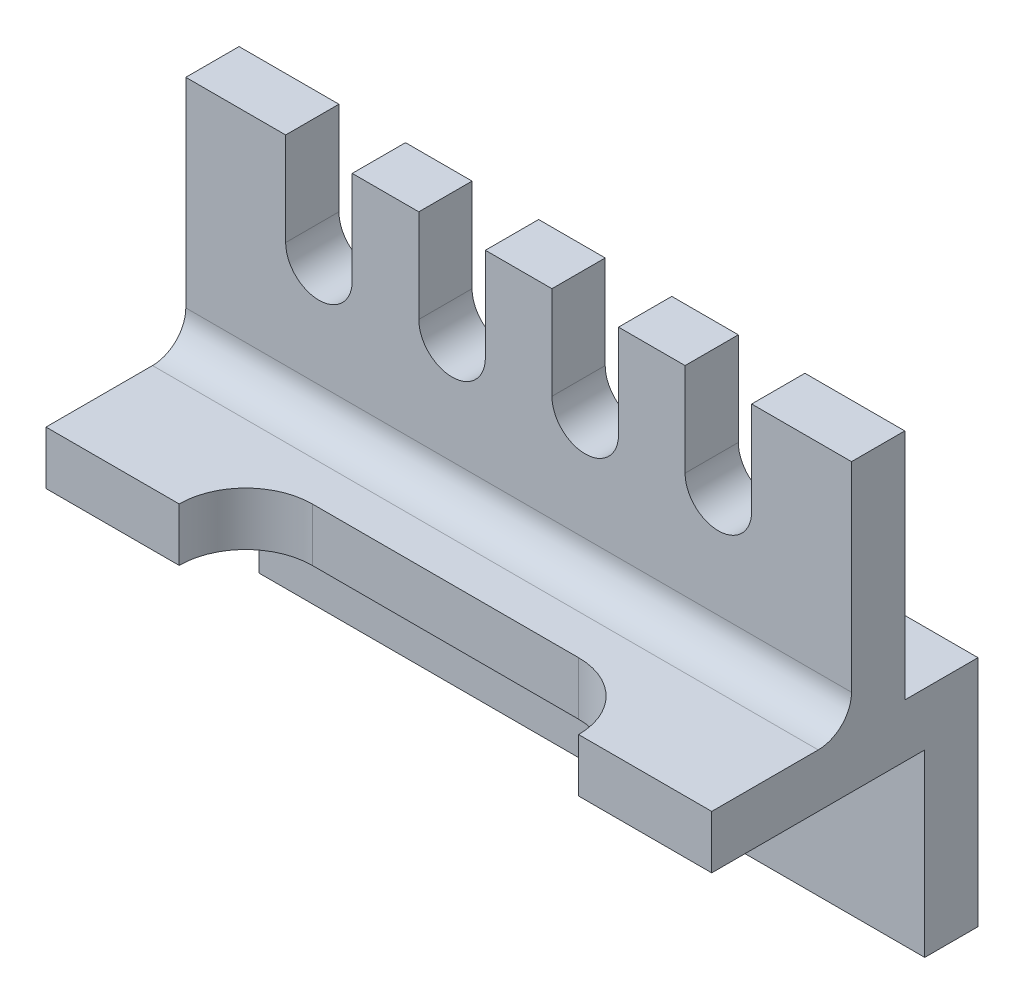
ISO-10303-21;
HEADER;
FILE_DESCRIPTION(('STEP AP214'),'2;1');
FILE_NAME('part.step','',(''),(''),'','','');
FILE_SCHEMA(('AUTOMOTIVE_DESIGN { 1 0 10303 214 1 1 1 1 }'));
ENDSEC;
DATA;
#1=APPLICATION_CONTEXT('core data for automotive mechanical design processes');
#2=APPLICATION_PROTOCOL_DEFINITION('international standard','automotive_design',2000,#1);
#3=PRODUCT_CONTEXT('',#1,'mechanical');
#4=PRODUCT('Part','Part','',(#3));
#5=PRODUCT_RELATED_PRODUCT_CATEGORY('part','',(#4));
#6=PRODUCT_DEFINITION_FORMATION('','',#4);
#7=PRODUCT_DEFINITION_CONTEXT('part definition',#1,'design');
#8=PRODUCT_DEFINITION('design','',#6,#7);
#9=PRODUCT_DEFINITION_SHAPE('','',#8);
#10=(LENGTH_UNIT() NAMED_UNIT(*) SI_UNIT(.MILLI.,.METRE.));
#11=(NAMED_UNIT(*) PLANE_ANGLE_UNIT() SI_UNIT($,.RADIAN.));
#12=(NAMED_UNIT(*) SI_UNIT($,.STERADIAN.) SOLID_ANGLE_UNIT());
#13=UNCERTAINTY_MEASURE_WITH_UNIT(LENGTH_MEASURE(1.E-05),#10,'distance_accuracy_value','');
#14=(GEOMETRIC_REPRESENTATION_CONTEXT(3) GLOBAL_UNCERTAINTY_ASSIGNED_CONTEXT((#13)) GLOBAL_UNIT_ASSIGNED_CONTEXT((#10,
#11,#12)) REPRESENTATION_CONTEXT('',''));
#15=CARTESIAN_POINT('',(0.,0.,0.));
#16=DIRECTION('',(0.,0.,1.));
#17=DIRECTION('',(1.,0.,0.));
#18=AXIS2_PLACEMENT_3D('',#15,#16,#17);
#19=CARTESIAN_POINT('',(0.,70.,0.));
#20=DIRECTION('',(0.,1.,0.));
#21=DIRECTION('',(0.,0.,1.));
#22=AXIS2_PLACEMENT_3D('',#19,#20,#21);
#23=PLANE('',#22);
#24=DIRECTION('',(0.,0.,1.));
#25=VECTOR('',#24,1.);
#26=CARTESIAN_POINT('',(-75.,70.,11.));
#27=LINE('',#26,#25);
#28=CARTESIAN_POINT('',(-75.,70.,11.));
#29=VERTEX_POINT('',#28);
#30=CARTESIAN_POINT('',(-75.,70.,19.));
#31=VERTEX_POINT('',#30);
#32=EDGE_CURVE('E274',#29,#31,#27,.T.);
#33=ORIENTED_EDGE('',*,*,#32,.T.);
#34=DIRECTION('',(1.,0.,0.));
#35=VECTOR('',#34,1.);
#36=CARTESIAN_POINT('',(-100.,70.,19.));
#37=LINE('',#36,#35);
#38=CARTESIAN_POINT('',(-65.,70.,19.));
#39=VERTEX_POINT('',#38);
#40=EDGE_CURVE('E365',#31,#39,#37,.T.);
#41=ORIENTED_EDGE('',*,*,#40,.T.);
#42=DIRECTION('',(0.,0.,1.));
#43=VECTOR('',#42,1.);
#44=CARTESIAN_POINT('',(-65.,70.,11.));
#45=LINE('',#44,#43);
#46=CARTESIAN_POINT('',(-65.,70.,11.));
#47=VERTEX_POINT('',#46);
#48=EDGE_CURVE('E280',#47,#39,#45,.T.);
#49=ORIENTED_EDGE('',*,*,#48,.F.);
#50=DIRECTION('',(-1.,0.,0.));
#51=VECTOR('',#50,1.);
#52=CARTESIAN_POINT('',(-100.,70.,11.));
#53=LINE('',#52,#51);
#54=EDGE_CURVE('E501',#47,#29,#53,.T.);
#55=ORIENTED_EDGE('',*,*,#54,.T.);
#56=EDGE_LOOP('',(#33,#41,#49,#55));
#57=FACE_BOUND('',#56,.T.);
#58=ADVANCED_FACE('F39',(#57),#23,.T.);
#59=DIRECTION('',(0.,0.,1.));
#60=VECTOR('',#59,1.);
#61=CARTESIAN_POINT('',(-55.,70.,11.));
#62=LINE('',#61,#60);
#63=CARTESIAN_POINT('',(-55.,70.,11.));
#64=VERTEX_POINT('',#63);
#65=CARTESIAN_POINT('',(-55.,70.,19.));
#66=VERTEX_POINT('',#65);
#67=EDGE_CURVE('E287',#64,#66,#62,.T.);
#68=ORIENTED_EDGE('',*,*,#67,.T.);
#69=CARTESIAN_POINT('',(-45.,70.,19.));
#70=VERTEX_POINT('',#69);
#71=EDGE_CURVE('E480',#66,#70,#37,.T.);
#72=ORIENTED_EDGE('',*,*,#71,.T.);
#73=DIRECTION('',(0.,0.,1.));
#74=VECTOR('',#73,1.);
#75=CARTESIAN_POINT('',(-45.,70.,11.));
#76=LINE('',#75,#74);
#77=CARTESIAN_POINT('',(-45.,70.,11.));
#78=VERTEX_POINT('',#77);
#79=EDGE_CURVE('E306',#78,#70,#76,.T.);
#80=ORIENTED_EDGE('',*,*,#79,.F.);
#81=EDGE_CURVE('E502',#78,#64,#53,.T.);
#82=ORIENTED_EDGE('',*,*,#81,.T.);
#83=EDGE_LOOP('',(#68,#72,#80,#82));
#84=FACE_BOUND('',#83,.T.);
#85=ADVANCED_FACE('F518',(#84),#23,.T.);
#86=DIRECTION('',(0.,0.,1.));
#87=VECTOR('',#86,1.);
#88=CARTESIAN_POINT('',(-35.,70.,11.));
#89=LINE('',#88,#87);
#90=CARTESIAN_POINT('',(-35.,70.,11.));
#91=VERTEX_POINT('',#90);
#92=CARTESIAN_POINT('',(-35.,70.,19.));
#93=VERTEX_POINT('',#92);
#94=EDGE_CURVE('E313',#91,#93,#89,.T.);
#95=ORIENTED_EDGE('',*,*,#94,.T.);
#96=CARTESIAN_POINT('',(-25.,70.,19.));
#97=VERTEX_POINT('',#96);
#98=EDGE_CURVE('E478',#93,#97,#37,.T.);
#99=ORIENTED_EDGE('',*,*,#98,.T.);
#100=DIRECTION('',(0.,0.,1.));
#101=VECTOR('',#100,1.);
#102=CARTESIAN_POINT('',(-25.,70.,11.));
#103=LINE('',#102,#101);
#104=CARTESIAN_POINT('',(-25.,70.,11.));
#105=VERTEX_POINT('',#104);
#106=EDGE_CURVE('E332',#105,#97,#103,.T.);
#107=ORIENTED_EDGE('',*,*,#106,.F.);
#108=EDGE_CURVE('E371',#105,#91,#53,.T.);
#109=ORIENTED_EDGE('',*,*,#108,.T.);
#110=EDGE_LOOP('',(#95,#99,#107,#109));
#111=FACE_BOUND('',#110,.T.);
#112=ADVANCED_FACE('F524',(#111),#23,.T.);
#113=DIRECTION('',(0.,0.,1.));
#114=VECTOR('',#113,1.);
#115=CARTESIAN_POINT('',(-15.,70.,11.));
#116=LINE('',#115,#114);
#117=CARTESIAN_POINT('',(-15.,70.,11.));
#118=VERTEX_POINT('',#117);
#119=CARTESIAN_POINT('',(-15.,70.,19.));
#120=VERTEX_POINT('',#119);
#121=EDGE_CURVE('E339',#118,#120,#116,.T.);
#122=ORIENTED_EDGE('',*,*,#121,.T.);
#123=CARTESIAN_POINT('',(0.,70.,19.));
#124=VERTEX_POINT('',#123);
#125=EDGE_CURVE('E360',#120,#124,#37,.T.);
#126=ORIENTED_EDGE('',*,*,#125,.T.);
#127=DIRECTION('',(0.,0.,-1.));
#128=VECTOR('',#127,1.);
#129=CARTESIAN_POINT('',(0.,70.,11.));
#130=LINE('',#129,#128);
#131=CARTESIAN_POINT('',(0.,70.,11.));
#132=VERTEX_POINT('',#131);
#133=EDGE_CURVE('E364',#124,#132,#130,.T.);
#134=ORIENTED_EDGE('',*,*,#133,.T.);
#135=EDGE_CURVE('E367',#132,#118,#53,.T.);
#136=ORIENTED_EDGE('',*,*,#135,.T.);
#137=EDGE_LOOP('',(#122,#126,#134,#136));
#138=FACE_BOUND('',#137,.T.);
#139=ADVANCED_FACE('F476',(#138),#23,.T.);
#140=CARTESIAN_POINT('',(0.,35.,0.));
#141=DIRECTION('',(0.,-1.,0.));
#142=DIRECTION('',(0.,0.,-1.));
#143=AXIS2_PLACEMENT_3D('',#140,#141,#142);
#144=PLANE('',#143);
#145=DIRECTION('',(-1.,0.,0.));
#146=VECTOR('',#145,1.);
#147=CARTESIAN_POINT('',(-100.,35.,11.));
#148=LINE('',#147,#146);
#149=CARTESIAN_POINT('',(0.,35.,11.));
#150=VERTEX_POINT('',#149);
#151=CARTESIAN_POINT('',(-100.,35.,11.));
#152=VERTEX_POINT('',#151);
#153=EDGE_CURVE('E277',#150,#152,#148,.T.);
#154=ORIENTED_EDGE('',*,*,#153,.F.);
#155=DIRECTION('',(0.,0.,-1.));
#156=VECTOR('',#155,1.);
#157=CARTESIAN_POINT('',(0.,35.,0.));
#158=LINE('',#157,#156);
#159=CARTESIAN_POINT('',(0.,35.,0.));
#160=VERTEX_POINT('',#159);
#161=EDGE_CURVE('E419',#150,#160,#158,.T.);
#162=ORIENTED_EDGE('',*,*,#161,.T.);
#163=DIRECTION('',(-1.,0.,0.));
#164=VECTOR('',#163,1.);
#165=CARTESIAN_POINT('',(0.,35.,0.));
#166=LINE('',#165,#164);
#167=CARTESIAN_POINT('',(-100.,35.,0.));
#168=VERTEX_POINT('',#167);
#169=EDGE_CURVE('E418',#160,#168,#166,.T.);
#170=ORIENTED_EDGE('',*,*,#169,.T.);
#171=DIRECTION('',(0.,0.,1.));
#172=VECTOR('',#171,1.);
#173=CARTESIAN_POINT('',(-100.,35.,0.));
#174=LINE('',#173,#172);
#175=EDGE_CURVE('E422',#168,#152,#174,.T.);
#176=ORIENTED_EDGE('',*,*,#175,.T.);
#177=EDGE_LOOP('',(#154,#162,#170,#176));
#178=FACE_BOUND('',#177,.T.);
#179=ADVANCED_FACE('F536',(#178),#144,.F.);
#180=CARTESIAN_POINT('',(0.,35.,40.));
#181=VERTEX_POINT('',#180);
#182=CARTESIAN_POINT('',(0.,35.,24.));
#183=VERTEX_POINT('',#182);
#184=EDGE_CURVE('E416',#181,#183,#158,.T.);
#185=ORIENTED_EDGE('',*,*,#184,.T.);
#186=DIRECTION('',(1.,0.,0.));
#187=VECTOR('',#186,1.);
#188=CARTESIAN_POINT('',(-100.,35.,24.));
#189=LINE('',#188,#187);
#190=CARTESIAN_POINT('',(-100.,35.,24.));
#191=VERTEX_POINT('',#190);
#192=EDGE_CURVE('E60',#183,#191,#189,.F.);
#193=ORIENTED_EDGE('',*,*,#192,.T.);
#194=CARTESIAN_POINT('',(-100.,35.,40.));
#195=VERTEX_POINT('',#194);
#196=EDGE_CURVE('E421',#191,#195,#174,.T.);
#197=ORIENTED_EDGE('',*,*,#196,.T.);
#198=DIRECTION('',(-1.,0.,0.));
#199=VECTOR('',#198,1.);
#200=CARTESIAN_POINT('',(-100.,35.,40.));
#201=LINE('',#200,#199);
#202=CARTESIAN_POINT('',(-80.,35.,40.));
#203=VERTEX_POINT('',#202);
#204=EDGE_CURVE('E406',#203,#195,#201,.T.);
#205=ORIENTED_EDGE('',*,*,#204,.F.);
#206=CARTESIAN_POINT('',(-70.,35.,40.));
#207=DIRECTION('',(0.,-1.,0.));
#208=DIRECTION('',(0.,0.,-1.));
#209=AXIS2_PLACEMENT_3D('',#206,#207,#208);
#210=CIRCLE('',#209,10.);
#211=CARTESIAN_POINT('',(-70.,35.,30.));
#212=VERTEX_POINT('',#211);
#213=EDGE_CURVE('E457',#203,#212,#210,.T.);
#214=ORIENTED_EDGE('',*,*,#213,.T.);
#215=DIRECTION('',(-1.,0.,0.));
#216=VECTOR('',#215,1.);
#217=CARTESIAN_POINT('',(-80.,35.,30.));
#218=LINE('',#217,#216);
#219=CARTESIAN_POINT('',(-30.,35.,30.));
#220=VERTEX_POINT('',#219);
#221=EDGE_CURVE('E388',#220,#212,#218,.T.);
#222=ORIENTED_EDGE('',*,*,#221,.F.);
#223=CARTESIAN_POINT('',(-30.,35.,40.));
#224=DIRECTION('',(0.,-1.,0.));
#225=DIRECTION('',(0.,0.,-1.));
#226=AXIS2_PLACEMENT_3D('',#223,#224,#225);
#227=CIRCLE('',#226,10.);
#228=CARTESIAN_POINT('',(-20.,35.,40.));
#229=VERTEX_POINT('',#228);
#230=EDGE_CURVE('E451',#220,#229,#227,.T.);
#231=ORIENTED_EDGE('',*,*,#230,.T.);
#232=EDGE_CURVE('E407',#181,#229,#201,.T.);
#233=ORIENTED_EDGE('',*,*,#232,.F.);
#234=EDGE_LOOP('',(#185,#193,#197,#205,#214,#222,#231,#233));
#235=FACE_BOUND('',#234,.T.);
#236=ADVANCED_FACE('F540',(#235),#144,.F.);
#237=CARTESIAN_POINT('',(0.,0.,40.));
#238=DIRECTION('',(0.,0.,1.));
#239=DIRECTION('',(1.,0.,0.));
#240=AXIS2_PLACEMENT_3D('',#237,#238,#239);
#241=PLANE('',#240);
#242=DIRECTION('',(0.,-1.,0.));
#243=VECTOR('',#242,1.);
#244=CARTESIAN_POINT('',(-80.,35.,40.));
#245=LINE('',#244,#243);
#246=CARTESIAN_POINT('',(-80.,27.,40.));
#247=VERTEX_POINT('',#246);
#248=EDGE_CURVE('E384',#203,#247,#245,.T.);
#249=ORIENTED_EDGE('',*,*,#248,.F.);
#250=ORIENTED_EDGE('',*,*,#204,.T.);
#251=DIRECTION('',(0.,-1.,0.));
#252=VECTOR('',#251,1.);
#253=CARTESIAN_POINT('',(-100.,35.,40.));
#254=LINE('',#253,#252);
#255=CARTESIAN_POINT('',(-100.,27.,40.));
#256=VERTEX_POINT('',#255);
#257=EDGE_CURVE('E392',#195,#256,#254,.T.);
#258=ORIENTED_EDGE('',*,*,#257,.T.);
#259=DIRECTION('',(1.,0.,0.));
#260=VECTOR('',#259,1.);
#261=CARTESIAN_POINT('',(-100.,27.,40.));
#262=LINE('',#261,#260);
#263=EDGE_CURVE('E400',#256,#247,#262,.T.);
#264=ORIENTED_EDGE('',*,*,#263,.T.);
#265=EDGE_LOOP('',(#249,#250,#258,#264));
#266=FACE_BOUND('',#265,.T.);
#267=ADVANCED_FACE('F664',(#266),#241,.T.);
#268=CARTESIAN_POINT('',(0.,35.,8.));
#269=DIRECTION('',(0.,0.,-1.));
#270=DIRECTION('',(-1.,0.,0.));
#271=AXIS2_PLACEMENT_3D('',#268,#269,#270);
#272=PLANE('',#271);
#273=DIRECTION('',(1.,0.,0.));
#274=VECTOR('',#273,1.);
#275=CARTESIAN_POINT('',(0.,27.,8.));
#276=LINE('',#275,#274);
#277=CARTESIAN_POINT('',(-100.,27.,8.00000000000001));
#278=VERTEX_POINT('',#277);
#279=CARTESIAN_POINT('',(0.,27.,8.));
#280=VERTEX_POINT('',#279);
#281=EDGE_CURVE('E443',#278,#280,#276,.T.);
#282=ORIENTED_EDGE('',*,*,#281,.F.);
#283=DIRECTION('',(0.,-1.,0.));
#284=VECTOR('',#283,1.);
#285=CARTESIAN_POINT('',(-100.,35.,8.00000000000001));
#286=LINE('',#285,#284);
#287=CARTESIAN_POINT('',(-100.,0.,8.00000000000001));
#288=VERTEX_POINT('',#287);
#289=EDGE_CURVE('E437',#278,#288,#286,.T.);
#290=ORIENTED_EDGE('',*,*,#289,.T.);
#291=DIRECTION('',(1.,0.,0.));
#292=VECTOR('',#291,1.);
#293=CARTESIAN_POINT('',(0.,0.,8.));
#294=LINE('',#293,#292);
#295=CARTESIAN_POINT('',(0.,0.,8.));
#296=VERTEX_POINT('',#295);
#297=EDGE_CURVE('E433',#288,#296,#294,.T.);
#298=ORIENTED_EDGE('',*,*,#297,.T.);
#299=DIRECTION('',(0.,-1.,0.));
#300=VECTOR('',#299,1.);
#301=CARTESIAN_POINT('',(0.,35.,8.));
#302=LINE('',#301,#300);
#303=EDGE_CURVE('E424',#280,#296,#302,.T.);
#304=ORIENTED_EDGE('',*,*,#303,.F.);
#305=EDGE_LOOP('',(#282,#290,#298,#304));
#306=FACE_BOUND('',#305,.T.);
#307=ADVANCED_FACE('F673',(#306),#272,.F.);
#308=CARTESIAN_POINT('',(0.,35.,0.));
#309=DIRECTION('',(-1.,0.,0.));
#310=DIRECTION('',(0.,0.,1.));
#311=AXIS2_PLACEMENT_3D('',#308,#309,#310);
#312=PLANE('',#311);
#313=ORIENTED_EDGE('',*,*,#184,.F.);
#314=DIRECTION('',(0.,1.,0.));
#315=VECTOR('',#314,1.);
#316=CARTESIAN_POINT('',(0.,35.,40.));
#317=LINE('',#316,#315);
#318=CARTESIAN_POINT('',(0.,27.,40.));
#319=VERTEX_POINT('',#318);
#320=EDGE_CURVE('E403',#319,#181,#317,.T.);
#321=ORIENTED_EDGE('',*,*,#320,.F.);
#322=DIRECTION('',(0.,0.,-1.));
#323=VECTOR('',#322,1.);
#324=CARTESIAN_POINT('',(0.,27.,40.));
#325=LINE('',#324,#323);
#326=EDGE_CURVE('E410',#319,#280,#325,.T.);
#327=ORIENTED_EDGE('',*,*,#326,.T.);
#328=ORIENTED_EDGE('',*,*,#303,.T.);
#329=DIRECTION('',(0.,0.,-1.));
#330=VECTOR('',#329,1.);
#331=CARTESIAN_POINT('',(0.,0.,0.));
#332=LINE('',#331,#330);
#333=CARTESIAN_POINT('',(0.,0.,0.));
#334=VERTEX_POINT('',#333);
#335=EDGE_CURVE('E415',#296,#334,#332,.T.);
#336=ORIENTED_EDGE('',*,*,#335,.T.);
#337=DIRECTION('',(0.,-1.,0.));
#338=VECTOR('',#337,1.);
#339=CARTESIAN_POINT('',(0.,35.,0.));
#340=LINE('',#339,#338);
#341=EDGE_CURVE('E441',#160,#334,#340,.T.);
#342=ORIENTED_EDGE('',*,*,#341,.F.);
#343=ORIENTED_EDGE('',*,*,#161,.F.);
#344=DIRECTION('',(0.,-1.,0.));
#345=VECTOR('',#344,1.);
#346=CARTESIAN_POINT('',(0.,70.,11.));
#347=LINE('',#346,#345);
#348=EDGE_CURVE('E376',#132,#150,#347,.T.);
#349=ORIENTED_EDGE('',*,*,#348,.F.);
#350=ORIENTED_EDGE('',*,*,#133,.F.);
#351=DIRECTION('',(0.,-1.,0.));
#352=VECTOR('',#351,1.);
#353=CARTESIAN_POINT('',(0.,70.,19.));
#354=LINE('',#353,#352);
#355=CARTESIAN_POINT('',(0.,40.,19.));
#356=VERTEX_POINT('',#355);
#357=EDGE_CURVE('E379',#124,#356,#354,.T.);
#358=ORIENTED_EDGE('',*,*,#357,.T.);
#359=CARTESIAN_POINT('',(0.,40.,24.));
#360=DIRECTION('',(-1.,0.,0.));
#361=DIRECTION('',(0.,0.,1.));
#362=AXIS2_PLACEMENT_3D('',#359,#360,#361);
#363=CIRCLE('',#362,5.);
#364=EDGE_CURVE('E47',#356,#183,#363,.T.);
#365=ORIENTED_EDGE('',*,*,#364,.T.);
#366=EDGE_LOOP('',(#313,#321,#327,#328,#336,#342,#343,#349,#350,#358,#365));
#367=FACE_BOUND('',#366,.T.);
#368=ADVANCED_FACE('F471',(#367),#312,.F.);
#369=CARTESIAN_POINT('',(0.,35.,0.));
#370=DIRECTION('',(0.,0.,1.));
#371=DIRECTION('',(1.,0.,0.));
#372=AXIS2_PLACEMENT_3D('',#369,#370,#371);
#373=PLANE('',#372);
#374=ORIENTED_EDGE('',*,*,#341,.T.);
#375=DIRECTION('',(-1.,0.,0.));
#376=VECTOR('',#375,1.);
#377=CARTESIAN_POINT('',(0.,0.,0.));
#378=LINE('',#377,#376);
#379=CARTESIAN_POINT('',(-100.,0.,0.));
#380=VERTEX_POINT('',#379);
#381=EDGE_CURVE('E427',#334,#380,#378,.T.);
#382=ORIENTED_EDGE('',*,*,#381,.T.);
#383=DIRECTION('',(0.,-1.,0.));
#384=VECTOR('',#383,1.);
#385=CARTESIAN_POINT('',(-100.,35.,0.));
#386=LINE('',#385,#384);
#387=EDGE_CURVE('E439',#168,#380,#386,.T.);
#388=ORIENTED_EDGE('',*,*,#387,.F.);
#389=ORIENTED_EDGE('',*,*,#169,.F.);
#390=EDGE_LOOP('',(#374,#382,#388,#389));
#391=FACE_BOUND('',#390,.T.);
#392=ADVANCED_FACE('F672',(#391),#373,.F.);
#393=CARTESIAN_POINT('',(-100.,35.,0.));
#394=DIRECTION('',(1.,0.,0.));
#395=DIRECTION('',(0.,0.,-1.));
#396=AXIS2_PLACEMENT_3D('',#393,#394,#395);
#397=PLANE('',#396);
#398=ORIENTED_EDGE('',*,*,#387,.T.);
#399=DIRECTION('',(0.,0.,1.));
#400=VECTOR('',#399,1.);
#401=CARTESIAN_POINT('',(-100.,0.,0.));
#402=LINE('',#401,#400);
#403=EDGE_CURVE('E430',#380,#288,#402,.T.);
#404=ORIENTED_EDGE('',*,*,#403,.T.);
#405=ORIENTED_EDGE('',*,*,#289,.F.);
#406=DIRECTION('',(0.,0.,-1.));
#407=VECTOR('',#406,1.);
#408=CARTESIAN_POINT('',(-100.,27.,40.));
#409=LINE('',#408,#407);
#410=EDGE_CURVE('E413',#256,#278,#409,.T.);
#411=ORIENTED_EDGE('',*,*,#410,.F.);
#412=ORIENTED_EDGE('',*,*,#257,.F.);
#413=ORIENTED_EDGE('',*,*,#196,.F.);
#414=CARTESIAN_POINT('',(-100.,40.,24.));
#415=DIRECTION('',(1.,0.,0.));
#416=DIRECTION('',(0.,0.,-1.));
#417=AXIS2_PLACEMENT_3D('',#414,#415,#416);
#418=CIRCLE('',#417,5.);
#419=CARTESIAN_POINT('',(-100.,40.,19.));
#420=VERTEX_POINT('',#419);
#421=EDGE_CURVE('E11',#191,#420,#418,.T.);
#422=ORIENTED_EDGE('',*,*,#421,.T.);
#423=DIRECTION('',(0.,-1.,0.));
#424=VECTOR('',#423,1.);
#425=CARTESIAN_POINT('',(-100.,70.,19.));
#426=LINE('',#425,#424);
#427=CARTESIAN_POINT('',(-100.,70.,19.));
#428=VERTEX_POINT('',#427);
#429=EDGE_CURVE('E381',#428,#420,#426,.T.);
#430=ORIENTED_EDGE('',*,*,#429,.F.);
#431=DIRECTION('',(0.,0.,1.));
#432=VECTOR('',#431,1.);
#433=CARTESIAN_POINT('',(-100.,70.,11.));
#434=LINE('',#433,#432);
#435=CARTESIAN_POINT('',(-100.,70.,11.));
#436=VERTEX_POINT('',#435);
#437=EDGE_CURVE('E357',#436,#428,#434,.T.);
#438=ORIENTED_EDGE('',*,*,#437,.F.);
#439=DIRECTION('',(0.,-1.,0.));
#440=VECTOR('',#439,1.);
#441=CARTESIAN_POINT('',(-100.,70.,11.));
#442=LINE('',#441,#440);
#443=EDGE_CURVE('E370',#436,#152,#442,.T.);
#444=ORIENTED_EDGE('',*,*,#443,.T.);
#445=ORIENTED_EDGE('',*,*,#175,.F.);
#446=EDGE_LOOP('',(#398,#404,#405,#411,#412,#413,#422,#430,#438,#444,#445));
#447=FACE_BOUND('',#446,.T.);
#448=ADVANCED_FACE('F509',(#447),#397,.F.);
#449=CARTESIAN_POINT('',(0.,0.,0.));
#450=DIRECTION('',(0.,-1.,0.));
#451=DIRECTION('',(0.,0.,-1.));
#452=AXIS2_PLACEMENT_3D('',#449,#450,#451);
#453=PLANE('',#452);
#454=ORIENTED_EDGE('',*,*,#335,.F.);
#455=ORIENTED_EDGE('',*,*,#297,.F.);
#456=ORIENTED_EDGE('',*,*,#403,.F.);
#457=ORIENTED_EDGE('',*,*,#381,.F.);
#458=EDGE_LOOP('',(#454,#455,#456,#457));
#459=FACE_BOUND('',#458,.T.);
#460=ADVANCED_FACE('F681',(#459),#453,.T.);
#461=CARTESIAN_POINT('',(-100.,27.,40.));
#462=DIRECTION('',(0.,1.,0.));
#463=DIRECTION('',(0.,0.,1.));
#464=AXIS2_PLACEMENT_3D('',#461,#462,#463);
#465=PLANE('',#464);
#466=DIRECTION('',(1.,0.,0.));
#467=VECTOR('',#466,1.);
#468=CARTESIAN_POINT('',(-80.,27.,30.));
#469=LINE('',#468,#467);
#470=CARTESIAN_POINT('',(-70.,27.,30.));
#471=VERTEX_POINT('',#470);
#472=CARTESIAN_POINT('',(-30.,27.,30.));
#473=VERTEX_POINT('',#472);
#474=EDGE_CURVE('E385',#471,#473,#469,.T.);
#475=ORIENTED_EDGE('',*,*,#474,.F.);
#476=CARTESIAN_POINT('',(-70.,27.,40.));
#477=DIRECTION('',(0.,1.,0.));
#478=DIRECTION('',(0.,0.,1.));
#479=AXIS2_PLACEMENT_3D('',#476,#477,#478);
#480=CIRCLE('',#479,10.);
#481=EDGE_CURVE('E455',#471,#247,#480,.T.);
#482=ORIENTED_EDGE('',*,*,#481,.T.);
#483=ORIENTED_EDGE('',*,*,#263,.F.);
#484=ORIENTED_EDGE('',*,*,#410,.T.);
#485=ORIENTED_EDGE('',*,*,#281,.T.);
#486=ORIENTED_EDGE('',*,*,#326,.F.);
#487=CARTESIAN_POINT('',(-20.,27.,40.));
#488=VERTEX_POINT('',#487);
#489=EDGE_CURVE('E399',#488,#319,#262,.T.);
#490=ORIENTED_EDGE('',*,*,#489,.F.);
#491=CARTESIAN_POINT('',(-30.,27.,40.));
#492=DIRECTION('',(0.,1.,0.));
#493=DIRECTION('',(0.,0.,1.));
#494=AXIS2_PLACEMENT_3D('',#491,#492,#493);
#495=CIRCLE('',#494,10.);
#496=EDGE_CURVE('E453',#488,#473,#495,.T.);
#497=ORIENTED_EDGE('',*,*,#496,.T.);
#498=EDGE_LOOP('',(#475,#482,#483,#484,#485,#486,#490,#497));
#499=FACE_BOUND('',#498,.T.);
#500=ADVANCED_FACE('F767',(#499),#465,.F.);
#501=DIRECTION('',(0.,1.,0.));
#502=VECTOR('',#501,1.);
#503=CARTESIAN_POINT('',(-20.,35.,40.));
#504=LINE('',#503,#502);
#505=EDGE_CURVE('E389',#488,#229,#504,.T.);
#506=ORIENTED_EDGE('',*,*,#505,.F.);
#507=ORIENTED_EDGE('',*,*,#489,.T.);
#508=ORIENTED_EDGE('',*,*,#320,.T.);
#509=ORIENTED_EDGE('',*,*,#232,.T.);
#510=EDGE_LOOP('',(#506,#507,#508,#509));
#511=FACE_BOUND('',#510,.T.);
#512=ADVANCED_FACE('F757',(#511),#241,.T.);
#513=CARTESIAN_POINT('',(0.,0.,30.));
#514=DIRECTION('',(0.,0.,1.));
#515=DIRECTION('',(1.,0.,0.));
#516=AXIS2_PLACEMENT_3D('',#513,#514,#515);
#517=PLANE('',#516);
#518=ORIENTED_EDGE('',*,*,#474,.T.);
#519=DIRECTION('',(0.,1.,0.));
#520=VECTOR('',#519,1.);
#521=CARTESIAN_POINT('',(-30.,0.,30.));
#522=LINE('',#521,#520);
#523=EDGE_CURVE('E448',#473,#220,#522,.T.);
#524=ORIENTED_EDGE('',*,*,#523,.T.);
#525=ORIENTED_EDGE('',*,*,#221,.T.);
#526=DIRECTION('',(0.,-1.,0.));
#527=VECTOR('',#526,1.);
#528=CARTESIAN_POINT('',(-70.,0.,30.));
#529=LINE('',#528,#527);
#530=EDGE_CURVE('E445',#212,#471,#529,.T.);
#531=ORIENTED_EDGE('',*,*,#530,.T.);
#532=EDGE_LOOP('',(#518,#524,#525,#531));
#533=FACE_BOUND('',#532,.T.);
#534=ADVANCED_FACE('F748',(#533),#517,.T.);
#535=CARTESIAN_POINT('',(-30.,0.,40.));
#536=DIRECTION('',(0.,1.,0.));
#537=DIRECTION('',(0.,0.,1.));
#538=AXIS2_PLACEMENT_3D('',#535,#536,#537);
#539=CYLINDRICAL_SURFACE('',#538,10.);
#540=ORIENTED_EDGE('',*,*,#496,.F.);
#541=ORIENTED_EDGE('',*,*,#505,.T.);
#542=ORIENTED_EDGE('',*,*,#230,.F.);
#543=ORIENTED_EDGE('',*,*,#523,.F.);
#544=EDGE_LOOP('',(#540,#541,#542,#543));
#545=FACE_BOUND('',#544,.T.);
#546=ADVANCED_FACE('F740',(#545),#539,.F.);
#547=CARTESIAN_POINT('',(-70.,0.,40.));
#548=DIRECTION('',(0.,-1.,0.));
#549=DIRECTION('',(0.,0.,-1.));
#550=AXIS2_PLACEMENT_3D('',#547,#548,#549);
#551=CYLINDRICAL_SURFACE('',#550,10.);
#552=ORIENTED_EDGE('',*,*,#213,.F.);
#553=ORIENTED_EDGE('',*,*,#248,.T.);
#554=ORIENTED_EDGE('',*,*,#481,.F.);
#555=ORIENTED_EDGE('',*,*,#530,.F.);
#556=EDGE_LOOP('',(#552,#553,#554,#555));
#557=FACE_BOUND('',#556,.T.);
#558=ADVANCED_FACE('F688',(#557),#551,.F.);
#559=CARTESIAN_POINT('',(-100.,70.,19.));
#560=DIRECTION('',(0.,0.,-1.));
#561=DIRECTION('',(-1.,0.,0.));
#562=AXIS2_PLACEMENT_3D('',#559,#560,#561);
#563=PLANE('',#562);
#564=ORIENTED_EDGE('',*,*,#429,.T.);
#565=DIRECTION('',(1.,0.,0.));
#566=VECTOR('',#565,1.);
#567=CARTESIAN_POINT('',(0.,40.,19.));
#568=LINE('',#567,#566);
#569=EDGE_CURVE('E459',#420,#356,#568,.T.);
#570=ORIENTED_EDGE('',*,*,#569,.T.);
#571=ORIENTED_EDGE('',*,*,#357,.F.);
#572=ORIENTED_EDGE('',*,*,#125,.F.);
#573=DIRECTION('',(0.,1.,0.));
#574=VECTOR('',#573,1.);
#575=CARTESIAN_POINT('',(-15.,56.,19.));
#576=LINE('',#575,#574);
#577=CARTESIAN_POINT('',(-15.,56.,19.));
#578=VERTEX_POINT('',#577);
#579=EDGE_CURVE('E342',#578,#120,#576,.T.);
#580=ORIENTED_EDGE('',*,*,#579,.F.);
#581=CARTESIAN_POINT('',(-20.,56.,19.));
#582=DIRECTION('',(0.,0.,1.));
#583=DIRECTION('',(1.,0.,0.));
#584=AXIS2_PLACEMENT_3D('',#581,#582,#583);
#585=CIRCLE('',#584,5.);
#586=CARTESIAN_POINT('',(-25.,56.,19.));
#587=VERTEX_POINT('',#586);
#588=EDGE_CURVE('E344',#587,#578,#585,.T.);
#589=ORIENTED_EDGE('',*,*,#588,.F.);
#590=DIRECTION('',(0.,-1.,0.));
#591=VECTOR('',#590,1.);
#592=CARTESIAN_POINT('',(-25.,70.,19.));
#593=LINE('',#592,#591);
#594=EDGE_CURVE('E316',#97,#587,#593,.T.);
#595=ORIENTED_EDGE('',*,*,#594,.F.);
#596=ORIENTED_EDGE('',*,*,#98,.F.);
#597=DIRECTION('',(0.,1.,0.));
#598=VECTOR('',#597,1.);
#599=CARTESIAN_POINT('',(-35.,56.,19.));
#600=LINE('',#599,#598);
#601=CARTESIAN_POINT('',(-35.,56.,19.));
#602=VERTEX_POINT('',#601);
#603=EDGE_CURVE('E317',#602,#93,#600,.T.);
#604=ORIENTED_EDGE('',*,*,#603,.F.);
#605=CARTESIAN_POINT('',(-40.,56.,19.));
#606=DIRECTION('',(0.,0.,1.));
#607=DIRECTION('',(1.,0.,0.));
#608=AXIS2_PLACEMENT_3D('',#605,#606,#607);
#609=CIRCLE('',#608,5.);
#610=CARTESIAN_POINT('',(-45.,56.,19.));
#611=VERTEX_POINT('',#610);
#612=EDGE_CURVE('E319',#611,#602,#609,.T.);
#613=ORIENTED_EDGE('',*,*,#612,.F.);
#614=DIRECTION('',(0.,-1.,0.));
#615=VECTOR('',#614,1.);
#616=CARTESIAN_POINT('',(-45.,70.,19.));
#617=LINE('',#616,#615);
#618=EDGE_CURVE('E290',#70,#611,#617,.T.);
#619=ORIENTED_EDGE('',*,*,#618,.F.);
#620=ORIENTED_EDGE('',*,*,#71,.F.);
#621=DIRECTION('',(0.,1.,0.));
#622=VECTOR('',#621,1.);
#623=CARTESIAN_POINT('',(-55.,56.,19.));
#624=LINE('',#623,#622);
#625=CARTESIAN_POINT('',(-55.,56.,19.));
#626=VERTEX_POINT('',#625);
#627=EDGE_CURVE('E291',#626,#66,#624,.T.);
#628=ORIENTED_EDGE('',*,*,#627,.F.);
#629=CARTESIAN_POINT('',(-60.,56.,19.));
#630=DIRECTION('',(0.,0.,1.));
#631=DIRECTION('',(1.,0.,0.));
#632=AXIS2_PLACEMENT_3D('',#629,#630,#631);
#633=CIRCLE('',#632,5.);
#634=CARTESIAN_POINT('',(-65.,56.,19.));
#635=VERTEX_POINT('',#634);
#636=EDGE_CURVE('E293',#635,#626,#633,.T.);
#637=ORIENTED_EDGE('',*,*,#636,.F.);
#638=DIRECTION('',(0.,-1.,0.));
#639=VECTOR('',#638,1.);
#640=CARTESIAN_POINT('',(-65.,70.,19.));
#641=LINE('',#640,#639);
#642=EDGE_CURVE('E272',#39,#635,#641,.T.);
#643=ORIENTED_EDGE('',*,*,#642,.F.);
#644=ORIENTED_EDGE('',*,*,#40,.F.);
#645=DIRECTION('',(0.,1.,0.));
#646=VECTOR('',#645,1.);
#647=CARTESIAN_POINT('',(-75.,56.,19.));
#648=LINE('',#647,#646);
#649=CARTESIAN_POINT('',(-75.,56.,19.));
#650=VERTEX_POINT('',#649);
#651=EDGE_CURVE('E265',#650,#31,#648,.T.);
#652=ORIENTED_EDGE('',*,*,#651,.F.);
#653=CARTESIAN_POINT('',(-80.,56.,19.));
#654=DIRECTION('',(0.,0.,1.));
#655=DIRECTION('',(1.,0.,0.));
#656=AXIS2_PLACEMENT_3D('',#653,#654,#655);
#657=CIRCLE('',#656,5.00000000000001);
#658=CARTESIAN_POINT('',(-85.,56.,19.));
#659=VERTEX_POINT('',#658);
#660=EDGE_CURVE('E267',#659,#650,#657,.T.);
#661=ORIENTED_EDGE('',*,*,#660,.F.);
#662=DIRECTION('',(0.,-1.,0.));
#663=VECTOR('',#662,1.);
#664=CARTESIAN_POINT('',(-85.,70.,19.));
#665=LINE('',#664,#663);
#666=CARTESIAN_POINT('',(-85.,70.,19.));
#667=VERTEX_POINT('',#666);
#668=EDGE_CURVE('E246',#667,#659,#665,.T.);
#669=ORIENTED_EDGE('',*,*,#668,.F.);
#670=EDGE_CURVE('E361',#428,#667,#37,.T.);
#671=ORIENTED_EDGE('',*,*,#670,.F.);
#672=EDGE_LOOP('',(#564,#570,#571,#572,#580,#589,#595,#596,#604,#613,#619,#620,#628,#637,#643,
#644,#652,#661,#669,#671));
#673=FACE_BOUND('',#672,.T.);
#674=ADVANCED_FACE('F465',(#673),#563,.F.);
#675=CARTESIAN_POINT('',(-100.,70.,11.));
#676=DIRECTION('',(0.,0.,1.));
#677=DIRECTION('',(1.,0.,0.));
#678=AXIS2_PLACEMENT_3D('',#675,#676,#677);
#679=PLANE('',#678);
#680=CARTESIAN_POINT('',(-80.,56.,11.));
#681=DIRECTION('',(0.,0.,1.));
#682=DIRECTION('',(1.,0.,0.));
#683=AXIS2_PLACEMENT_3D('',#680,#681,#682);
#684=CIRCLE('',#683,5.00000000000001);
#685=CARTESIAN_POINT('',(-85.,56.,11.));
#686=VERTEX_POINT('',#685);
#687=CARTESIAN_POINT('',(-75.,56.,11.));
#688=VERTEX_POINT('',#687);
#689=EDGE_CURVE('E254',#686,#688,#684,.T.);
#690=ORIENTED_EDGE('',*,*,#689,.T.);
#691=DIRECTION('',(0.,1.,0.));
#692=VECTOR('',#691,1.);
#693=CARTESIAN_POINT('',(-75.,56.,11.));
#694=LINE('',#693,#692);
#695=EDGE_CURVE('E259',#688,#29,#694,.T.);
#696=ORIENTED_EDGE('',*,*,#695,.T.);
#697=ORIENTED_EDGE('',*,*,#54,.F.);
#698=DIRECTION('',(0.,-1.,0.));
#699=VECTOR('',#698,1.);
#700=CARTESIAN_POINT('',(-65.,70.,11.));
#701=LINE('',#700,#699);
#702=CARTESIAN_POINT('',(-65.,56.,11.));
#703=VERTEX_POINT('',#702);
#704=EDGE_CURVE('E294',#47,#703,#701,.T.);
#705=ORIENTED_EDGE('',*,*,#704,.T.);
#706=CARTESIAN_POINT('',(-60.,56.,11.));
#707=DIRECTION('',(0.,0.,1.));
#708=DIRECTION('',(1.,0.,0.));
#709=AXIS2_PLACEMENT_3D('',#706,#707,#708);
#710=CIRCLE('',#709,5.);
#711=CARTESIAN_POINT('',(-55.,56.,11.));
#712=VERTEX_POINT('',#711);
#713=EDGE_CURVE('E301',#703,#712,#710,.T.);
#714=ORIENTED_EDGE('',*,*,#713,.T.);
#715=DIRECTION('',(0.,1.,0.));
#716=VECTOR('',#715,1.);
#717=CARTESIAN_POINT('',(-55.,56.,11.));
#718=LINE('',#717,#716);
#719=EDGE_CURVE('E282',#712,#64,#718,.T.);
#720=ORIENTED_EDGE('',*,*,#719,.T.);
#721=ORIENTED_EDGE('',*,*,#81,.F.);
#722=DIRECTION('',(0.,-1.,0.));
#723=VECTOR('',#722,1.);
#724=CARTESIAN_POINT('',(-45.,70.,11.));
#725=LINE('',#724,#723);
#726=CARTESIAN_POINT('',(-45.,56.,11.));
#727=VERTEX_POINT('',#726);
#728=EDGE_CURVE('E320',#78,#727,#725,.T.);
#729=ORIENTED_EDGE('',*,*,#728,.T.);
#730=CARTESIAN_POINT('',(-40.,56.,11.));
#731=DIRECTION('',(0.,0.,1.));
#732=DIRECTION('',(1.,0.,0.));
#733=AXIS2_PLACEMENT_3D('',#730,#731,#732);
#734=CIRCLE('',#733,5.);
#735=CARTESIAN_POINT('',(-35.,56.,11.));
#736=VERTEX_POINT('',#735);
#737=EDGE_CURVE('E327',#727,#736,#734,.T.);
#738=ORIENTED_EDGE('',*,*,#737,.T.);
#739=DIRECTION('',(0.,1.,0.));
#740=VECTOR('',#739,1.);
#741=CARTESIAN_POINT('',(-35.,56.,11.));
#742=LINE('',#741,#740);
#743=EDGE_CURVE('E308',#736,#91,#742,.T.);
#744=ORIENTED_EDGE('',*,*,#743,.T.);
#745=ORIENTED_EDGE('',*,*,#108,.F.);
#746=DIRECTION('',(0.,-1.,0.));
#747=VECTOR('',#746,1.);
#748=CARTESIAN_POINT('',(-25.,70.,11.));
#749=LINE('',#748,#747);
#750=CARTESIAN_POINT('',(-25.,56.,11.));
#751=VERTEX_POINT('',#750);
#752=EDGE_CURVE('E345',#105,#751,#749,.T.);
#753=ORIENTED_EDGE('',*,*,#752,.T.);
#754=CARTESIAN_POINT('',(-20.,56.,11.));
#755=DIRECTION('',(0.,0.,1.));
#756=DIRECTION('',(1.,0.,0.));
#757=AXIS2_PLACEMENT_3D('',#754,#755,#756);
#758=CIRCLE('',#757,5.);
#759=CARTESIAN_POINT('',(-15.,56.,11.));
#760=VERTEX_POINT('',#759);
#761=EDGE_CURVE('E352',#751,#760,#758,.T.);
#762=ORIENTED_EDGE('',*,*,#761,.T.);
#763=DIRECTION('',(0.,1.,0.));
#764=VECTOR('',#763,1.);
#765=CARTESIAN_POINT('',(-15.,56.,11.));
#766=LINE('',#765,#764);
#767=EDGE_CURVE('E334',#760,#118,#766,.T.);
#768=ORIENTED_EDGE('',*,*,#767,.T.);
#769=ORIENTED_EDGE('',*,*,#135,.F.);
#770=ORIENTED_EDGE('',*,*,#348,.T.);
#771=ORIENTED_EDGE('',*,*,#153,.T.);
#772=ORIENTED_EDGE('',*,*,#443,.F.);
#773=CARTESIAN_POINT('',(-85.,70.,11.));
#774=VERTEX_POINT('',#773);
#775=EDGE_CURVE('E264',#774,#436,#53,.T.);
#776=ORIENTED_EDGE('',*,*,#775,.F.);
#777=DIRECTION('',(0.,-1.,0.));
#778=VECTOR('',#777,1.);
#779=CARTESIAN_POINT('',(-85.,70.,11.));
#780=LINE('',#779,#778);
#781=EDGE_CURVE('E243',#774,#686,#780,.T.);
#782=ORIENTED_EDGE('',*,*,#781,.T.);
#783=EDGE_LOOP('',(#690,#696,#697,#705,#714,#720,#721,#729,#738,#744,#745,#753,#762,#768,#769,
#770,#771,#772,#776,#782));
#784=FACE_BOUND('',#783,.T.);
#785=ADVANCED_FACE('F262',(#784),#679,.F.);
#786=DIRECTION('',(0.,0.,1.));
#787=VECTOR('',#786,1.);
#788=CARTESIAN_POINT('',(-85.,70.,11.));
#789=LINE('',#788,#787);
#790=EDGE_CURVE('E251',#774,#667,#789,.T.);
#791=ORIENTED_EDGE('',*,*,#790,.F.);
#792=ORIENTED_EDGE('',*,*,#775,.T.);
#793=ORIENTED_EDGE('',*,*,#437,.T.);
#794=ORIENTED_EDGE('',*,*,#670,.T.);
#795=EDGE_LOOP('',(#791,#792,#793,#794));
#796=FACE_BOUND('',#795,.T.);
#797=ADVANCED_FACE('F505',(#796),#23,.T.);
#798=CARTESIAN_POINT('',(-15.,56.,11.));
#799=DIRECTION('',(1.,0.,0.));
#800=DIRECTION('',(0.,0.,-1.));
#801=AXIS2_PLACEMENT_3D('',#798,#799,#800);
#802=PLANE('',#801);
#803=ORIENTED_EDGE('',*,*,#579,.T.);
#804=ORIENTED_EDGE('',*,*,#121,.F.);
#805=ORIENTED_EDGE('',*,*,#767,.F.);
#806=DIRECTION('',(0.,0.,1.));
#807=VECTOR('',#806,1.);
#808=CARTESIAN_POINT('',(-15.,56.,11.));
#809=LINE('',#808,#807);
#810=EDGE_CURVE('E337',#760,#578,#809,.T.);
#811=ORIENTED_EDGE('',*,*,#810,.T.);
#812=EDGE_LOOP('',(#803,#804,#805,#811));
#813=FACE_BOUND('',#812,.T.);
#814=ADVANCED_FACE('F528',(#813),#802,.F.);
#815=CARTESIAN_POINT('',(-20.,56.,11.));
#816=DIRECTION('',(0.,0.,1.));
#817=DIRECTION('',(1.,0.,0.));
#818=AXIS2_PLACEMENT_3D('',#815,#816,#817);
#819=CYLINDRICAL_SURFACE('',#818,5.);
#820=ORIENTED_EDGE('',*,*,#588,.T.);
#821=ORIENTED_EDGE('',*,*,#810,.F.);
#822=ORIENTED_EDGE('',*,*,#761,.F.);
#823=DIRECTION('',(0.,0.,1.));
#824=VECTOR('',#823,1.);
#825=CARTESIAN_POINT('',(-25.,56.,11.));
#826=LINE('',#825,#824);
#827=EDGE_CURVE('E335',#751,#587,#826,.T.);
#828=ORIENTED_EDGE('',*,*,#827,.T.);
#829=EDGE_LOOP('',(#820,#821,#822,#828));
#830=FACE_BOUND('',#829,.T.);
#831=ADVANCED_FACE('F533',(#830),#819,.F.);
#832=CARTESIAN_POINT('',(-25.,70.,11.));
#833=DIRECTION('',(-1.,0.,0.));
#834=DIRECTION('',(0.,0.,1.));
#835=AXIS2_PLACEMENT_3D('',#832,#833,#834);
#836=PLANE('',#835);
#837=ORIENTED_EDGE('',*,*,#594,.T.);
#838=ORIENTED_EDGE('',*,*,#827,.F.);
#839=ORIENTED_EDGE('',*,*,#752,.F.);
#840=ORIENTED_EDGE('',*,*,#106,.T.);
#841=EDGE_LOOP('',(#837,#838,#839,#840));
#842=FACE_BOUND('',#841,.T.);
#843=ADVANCED_FACE('F554',(#842),#836,.F.);
#844=CARTESIAN_POINT('',(-35.,56.,11.));
#845=DIRECTION('',(1.,0.,0.));
#846=DIRECTION('',(0.,1.,0.));
#847=AXIS2_PLACEMENT_3D('',#844,#845,#846);
#848=PLANE('',#847);
#849=ORIENTED_EDGE('',*,*,#603,.T.);
#850=ORIENTED_EDGE('',*,*,#94,.F.);
#851=ORIENTED_EDGE('',*,*,#743,.F.);
#852=DIRECTION('',(0.,0.,1.));
#853=VECTOR('',#852,1.);
#854=CARTESIAN_POINT('',(-35.,56.,11.));
#855=LINE('',#854,#853);
#856=EDGE_CURVE('E311',#736,#602,#855,.T.);
#857=ORIENTED_EDGE('',*,*,#856,.T.);
#858=EDGE_LOOP('',(#849,#850,#851,#857));
#859=FACE_BOUND('',#858,.T.);
#860=ADVANCED_FACE('F557',(#859),#848,.F.);
#861=CARTESIAN_POINT('',(-40.,56.,11.));
#862=DIRECTION('',(0.,0.,1.));
#863=DIRECTION('',(1.,0.,0.));
#864=AXIS2_PLACEMENT_3D('',#861,#862,#863);
#865=CYLINDRICAL_SURFACE('',#864,5.);
#866=ORIENTED_EDGE('',*,*,#612,.T.);
#867=ORIENTED_EDGE('',*,*,#856,.F.);
#868=ORIENTED_EDGE('',*,*,#737,.F.);
#869=DIRECTION('',(0.,0.,1.));
#870=VECTOR('',#869,1.);
#871=CARTESIAN_POINT('',(-45.,56.,11.));
#872=LINE('',#871,#870);
#873=EDGE_CURVE('E309',#727,#611,#872,.T.);
#874=ORIENTED_EDGE('',*,*,#873,.T.);
#875=EDGE_LOOP('',(#866,#867,#868,#874));
#876=FACE_BOUND('',#875,.T.);
#877=ADVANCED_FACE('F559',(#876),#865,.F.);
#878=CARTESIAN_POINT('',(-45.,70.,11.));
#879=DIRECTION('',(-1.,0.,0.));
#880=DIRECTION('',(0.,-1.,0.));
#881=AXIS2_PLACEMENT_3D('',#878,#879,#880);
#882=PLANE('',#881);
#883=ORIENTED_EDGE('',*,*,#618,.T.);
#884=ORIENTED_EDGE('',*,*,#873,.F.);
#885=ORIENTED_EDGE('',*,*,#728,.F.);
#886=ORIENTED_EDGE('',*,*,#79,.T.);
#887=EDGE_LOOP('',(#883,#884,#885,#886));
#888=FACE_BOUND('',#887,.T.);
#889=ADVANCED_FACE('F562',(#888),#882,.F.);
#890=CARTESIAN_POINT('',(-55.,56.,11.));
#891=DIRECTION('',(1.,0.,0.));
#892=DIRECTION('',(0.,0.,-1.));
#893=AXIS2_PLACEMENT_3D('',#890,#891,#892);
#894=PLANE('',#893);
#895=ORIENTED_EDGE('',*,*,#627,.T.);
#896=ORIENTED_EDGE('',*,*,#67,.F.);
#897=ORIENTED_EDGE('',*,*,#719,.F.);
#898=DIRECTION('',(0.,0.,1.));
#899=VECTOR('',#898,1.);
#900=CARTESIAN_POINT('',(-55.,56.,11.));
#901=LINE('',#900,#899);
#902=EDGE_CURVE('E285',#712,#626,#901,.T.);
#903=ORIENTED_EDGE('',*,*,#902,.T.);
#904=EDGE_LOOP('',(#895,#896,#897,#903));
#905=FACE_BOUND('',#904,.T.);
#906=ADVANCED_FACE('F566',(#905),#894,.F.);
#907=CARTESIAN_POINT('',(-60.,56.,11.));
#908=DIRECTION('',(0.,0.,1.));
#909=DIRECTION('',(1.,0.,0.));
#910=AXIS2_PLACEMENT_3D('',#907,#908,#909);
#911=CYLINDRICAL_SURFACE('',#910,5.);
#912=ORIENTED_EDGE('',*,*,#636,.T.);
#913=ORIENTED_EDGE('',*,*,#902,.F.);
#914=ORIENTED_EDGE('',*,*,#713,.F.);
#915=DIRECTION('',(0.,0.,1.));
#916=VECTOR('',#915,1.);
#917=CARTESIAN_POINT('',(-65.,56.,11.));
#918=LINE('',#917,#916);
#919=EDGE_CURVE('E283',#703,#635,#918,.T.);
#920=ORIENTED_EDGE('',*,*,#919,.T.);
#921=EDGE_LOOP('',(#912,#913,#914,#920));
#922=FACE_BOUND('',#921,.T.);
#923=ADVANCED_FACE('F568',(#922),#911,.F.);
#924=CARTESIAN_POINT('',(-65.,70.,11.));
#925=DIRECTION('',(-1.,0.,0.));
#926=DIRECTION('',(0.,0.,1.));
#927=AXIS2_PLACEMENT_3D('',#924,#925,#926);
#928=PLANE('',#927);
#929=ORIENTED_EDGE('',*,*,#642,.T.);
#930=ORIENTED_EDGE('',*,*,#919,.F.);
#931=ORIENTED_EDGE('',*,*,#704,.F.);
#932=ORIENTED_EDGE('',*,*,#48,.T.);
#933=EDGE_LOOP('',(#929,#930,#931,#932));
#934=FACE_BOUND('',#933,.T.);
#935=ADVANCED_FACE('F499',(#934),#928,.F.);
#936=CARTESIAN_POINT('',(-75.,56.,11.));
#937=DIRECTION('',(1.,0.,0.));
#938=DIRECTION('',(0.,1.,0.));
#939=AXIS2_PLACEMENT_3D('',#936,#937,#938);
#940=PLANE('',#939);
#941=ORIENTED_EDGE('',*,*,#651,.T.);
#942=ORIENTED_EDGE('',*,*,#32,.F.);
#943=ORIENTED_EDGE('',*,*,#695,.F.);
#944=DIRECTION('',(0.,0.,1.));
#945=VECTOR('',#944,1.);
#946=CARTESIAN_POINT('',(-75.,56.,11.));
#947=LINE('',#946,#945);
#948=EDGE_CURVE('E250',#688,#650,#947,.T.);
#949=ORIENTED_EDGE('',*,*,#948,.T.);
#950=EDGE_LOOP('',(#941,#942,#943,#949));
#951=FACE_BOUND('',#950,.T.);
#952=ADVANCED_FACE('F575',(#951),#940,.F.);
#953=CARTESIAN_POINT('',(-80.,56.,11.));
#954=DIRECTION('',(0.,0.,1.));
#955=DIRECTION('',(1.,0.,0.));
#956=AXIS2_PLACEMENT_3D('',#953,#954,#955);
#957=CYLINDRICAL_SURFACE('',#956,5.00000000000001);
#958=ORIENTED_EDGE('',*,*,#660,.T.);
#959=ORIENTED_EDGE('',*,*,#948,.F.);
#960=ORIENTED_EDGE('',*,*,#689,.F.);
#961=DIRECTION('',(0.,0.,1.));
#962=VECTOR('',#961,1.);
#963=CARTESIAN_POINT('',(-85.,56.,11.));
#964=LINE('',#963,#962);
#965=EDGE_CURVE('E239',#686,#659,#964,.T.);
#966=ORIENTED_EDGE('',*,*,#965,.T.);
#967=EDGE_LOOP('',(#958,#959,#960,#966));
#968=FACE_BOUND('',#967,.T.);
#969=ADVANCED_FACE('F255',(#968),#957,.F.);
#970=CARTESIAN_POINT('',(-85.,70.,11.));
#971=DIRECTION('',(-1.,0.,0.));
#972=DIRECTION('',(0.,0.,1.));
#973=AXIS2_PLACEMENT_3D('',#970,#971,#972);
#974=PLANE('',#973);
#975=ORIENTED_EDGE('',*,*,#668,.T.);
#976=ORIENTED_EDGE('',*,*,#965,.F.);
#977=ORIENTED_EDGE('',*,*,#781,.F.);
#978=ORIENTED_EDGE('',*,*,#790,.T.);
#979=EDGE_LOOP('',(#975,#976,#977,#978));
#980=FACE_BOUND('',#979,.T.);
#981=ADVANCED_FACE('F241',(#980),#974,.F.);
#982=CARTESIAN_POINT('',(-100.,40.,24.));
#983=DIRECTION('',(-1.,0.,0.));
#984=DIRECTION('',(0.,0.,1.));
#985=AXIS2_PLACEMENT_3D('',#982,#983,#984);
#986=CYLINDRICAL_SURFACE('',#985,5.);
#987=ORIENTED_EDGE('',*,*,#421,.F.);
#988=ORIENTED_EDGE('',*,*,#192,.F.);
#989=ORIENTED_EDGE('',*,*,#364,.F.);
#990=ORIENTED_EDGE('',*,*,#569,.F.);
#991=EDGE_LOOP('',(#987,#988,#989,#990));
#992=FACE_BOUND('',#991,.T.);
#993=ADVANCED_FACE('F41',(#992),#986,.F.);
#994=CLOSED_SHELL('',(#58,#85,#112,#139,#179,#236,#267,#307,#368,#392,#448,#460,#500,#512,#534,
#546,#558,#674,#785,#797,#814,#831,#843,#860,#877,#889,#906,#923,#935,#952,#969,#981,#993));
#995=MANIFOLD_SOLID_BREP('B2',#994);
#996=ADVANCED_BREP_SHAPE_REPRESENTATION('',(#18,#995),#14);
#997=SHAPE_DEFINITION_REPRESENTATION(#9,#996);
ENDSEC;
END-ISO-10303-21;
